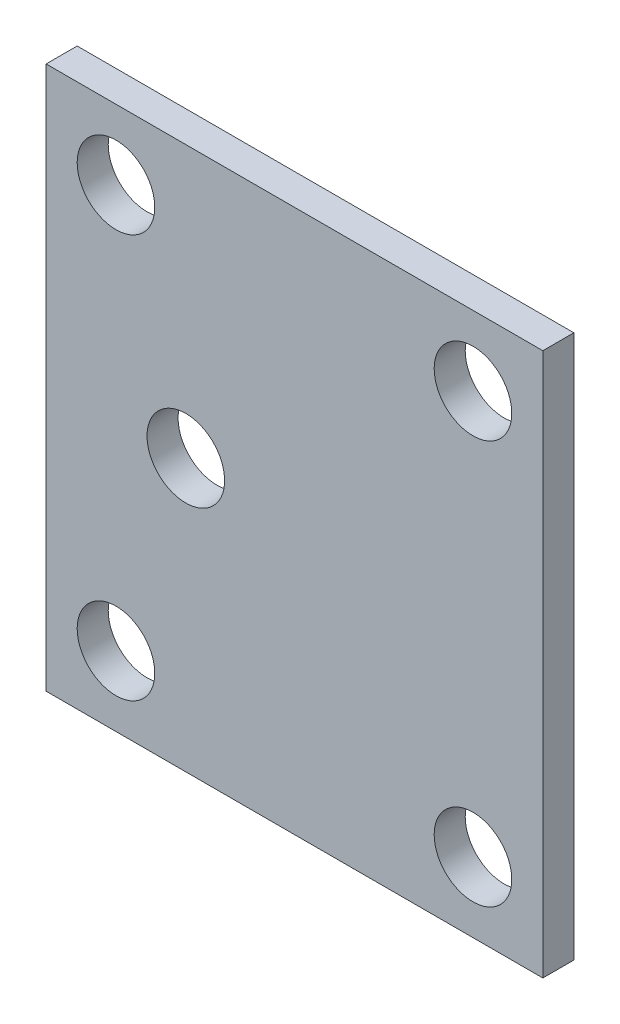
ISO-10303-21;
HEADER;
FILE_DESCRIPTION(('STEP AP214'),'2;1');
FILE_NAME('part.step','',(''),(''),'','','');
FILE_SCHEMA(('AUTOMOTIVE_DESIGN { 1 0 10303 214 1 1 1 1 }'));
ENDSEC;
DATA;
#1=APPLICATION_CONTEXT('core data for automotive mechanical design processes');
#2=APPLICATION_PROTOCOL_DEFINITION('international standard','automotive_design',2000,#1);
#3=PRODUCT_CONTEXT('',#1,'mechanical');
#4=PRODUCT('Part','Part','',(#3));
#5=PRODUCT_RELATED_PRODUCT_CATEGORY('part','',(#4));
#6=PRODUCT_DEFINITION_FORMATION('','',#4);
#7=PRODUCT_DEFINITION_CONTEXT('part definition',#1,'design');
#8=PRODUCT_DEFINITION('design','',#6,#7);
#9=PRODUCT_DEFINITION_SHAPE('','',#8);
#10=(LENGTH_UNIT() NAMED_UNIT(*) SI_UNIT(.MILLI.,.METRE.));
#11=(NAMED_UNIT(*) PLANE_ANGLE_UNIT() SI_UNIT($,.RADIAN.));
#12=(NAMED_UNIT(*) SI_UNIT($,.STERADIAN.) SOLID_ANGLE_UNIT());
#13=UNCERTAINTY_MEASURE_WITH_UNIT(LENGTH_MEASURE(1.E-05),#10,'distance_accuracy_value','');
#14=(GEOMETRIC_REPRESENTATION_CONTEXT(3) GLOBAL_UNCERTAINTY_ASSIGNED_CONTEXT((#13)) GLOBAL_UNIT_ASSIGNED_CONTEXT((#10,
#11,#12)) REPRESENTATION_CONTEXT('',''));
#15=CARTESIAN_POINT('',(0.,0.,0.));
#16=DIRECTION('',(0.,0.,1.));
#17=DIRECTION('',(1.,0.,0.));
#18=AXIS2_PLACEMENT_3D('',#15,#16,#17);
#19=CARTESIAN_POINT('',(0.,0.,2.));
#20=DIRECTION('',(0.,0.,1.));
#21=DIRECTION('',(1.,0.,0.));
#22=AXIS2_PLACEMENT_3D('',#19,#20,#21);
#23=PLANE('',#22);
#24=CARTESIAN_POINT('',(-5.33,-5.24999999999999,2.));
#25=DIRECTION('',(0.,0.,-1.));
#26=DIRECTION('',(-1.,0.,0.));
#27=AXIS2_PLACEMENT_3D('',#24,#25,#26);
#28=CIRCLE('',#27,2.5);
#29=CARTESIAN_POINT('',(-7.82999999999999,-5.24999999999999,2.));
#30=VERTEX_POINT('',#29);
#31=EDGE_CURVE('E146',#30,#30,#28,.T.);
#32=ORIENTED_EDGE('',*,*,#31,.T.);
#33=EDGE_LOOP('',(#32));
#34=FACE_BOUND('',#33,.T.);
#35=DIRECTION('',(0.,-1.,0.));
#36=VECTOR('',#35,1.);
#37=CARTESIAN_POINT('',(-14.33,12.25,2.));
#38=LINE('',#37,#36);
#39=CARTESIAN_POINT('',(-14.33,12.25,2.));
#40=VERTEX_POINT('',#39);
#41=CARTESIAN_POINT('',(-14.33,-22.75,2.));
#42=VERTEX_POINT('',#41);
#43=EDGE_CURVE('E97',#40,#42,#38,.T.);
#44=ORIENTED_EDGE('',*,*,#43,.T.);
#45=DIRECTION('',(1.,0.,0.));
#46=VECTOR('',#45,1.);
#47=CARTESIAN_POINT('',(-14.33,-22.75,2.));
#48=LINE('',#47,#46);
#49=CARTESIAN_POINT('',(17.67,-22.75,2.));
#50=VERTEX_POINT('',#49);
#51=EDGE_CURVE('E92',#42,#50,#48,.T.);
#52=ORIENTED_EDGE('',*,*,#51,.T.);
#53=DIRECTION('',(0.,1.,0.));
#54=VECTOR('',#53,1.);
#55=CARTESIAN_POINT('',(17.67,12.25,2.));
#56=LINE('',#55,#54);
#57=CARTESIAN_POINT('',(17.67,12.25,2.));
#58=VERTEX_POINT('',#57);
#59=EDGE_CURVE('E95',#50,#58,#56,.T.);
#60=ORIENTED_EDGE('',*,*,#59,.T.);
#61=DIRECTION('',(-1.,0.,0.));
#62=VECTOR('',#61,1.);
#63=CARTESIAN_POINT('',(-14.33,12.25,2.));
#64=LINE('',#63,#62);
#65=EDGE_CURVE('E62',#58,#40,#64,.T.);
#66=ORIENTED_EDGE('',*,*,#65,.T.);
#67=EDGE_LOOP('',(#44,#52,#60,#66));
#68=FACE_BOUND('',#67,.T.);
#69=CARTESIAN_POINT('',(-9.83,7.75,2.));
#70=DIRECTION('',(0.,0.,-1.));
#71=DIRECTION('',(-1.,0.,0.));
#72=AXIS2_PLACEMENT_3D('',#69,#70,#71);
#73=CIRCLE('',#72,2.5);
#74=CARTESIAN_POINT('',(-12.33,7.75,2.));
#75=VERTEX_POINT('',#74);
#76=EDGE_CURVE('E112',#75,#75,#73,.T.);
#77=ORIENTED_EDGE('',*,*,#76,.T.);
#78=EDGE_LOOP('',(#77));
#79=FACE_BOUND('',#78,.T.);
#80=CARTESIAN_POINT('',(13.17,7.75,2.));
#81=DIRECTION('',(0.,0.,-1.));
#82=DIRECTION('',(-1.,0.,0.));
#83=AXIS2_PLACEMENT_3D('',#80,#81,#82);
#84=CIRCLE('',#83,2.5);
#85=CARTESIAN_POINT('',(10.67,7.75,2.));
#86=VERTEX_POINT('',#85);
#87=EDGE_CURVE('E128',#86,#86,#84,.T.);
#88=ORIENTED_EDGE('',*,*,#87,.T.);
#89=EDGE_LOOP('',(#88));
#90=FACE_BOUND('',#89,.T.);
#91=CARTESIAN_POINT('',(13.17,-18.25,2.));
#92=DIRECTION('',(0.,0.,-1.));
#93=DIRECTION('',(-1.,0.,0.));
#94=AXIS2_PLACEMENT_3D('',#91,#92,#93);
#95=CIRCLE('',#94,2.5);
#96=CARTESIAN_POINT('',(10.67,-18.25,2.));
#97=VERTEX_POINT('',#96);
#98=EDGE_CURVE('E134',#97,#97,#95,.T.);
#99=ORIENTED_EDGE('',*,*,#98,.T.);
#100=EDGE_LOOP('',(#99));
#101=FACE_BOUND('',#100,.T.);
#102=CARTESIAN_POINT('',(-9.82999999999999,-18.25,2.));
#103=DIRECTION('',(0.,0.,-1.));
#104=DIRECTION('',(-1.,0.,0.));
#105=AXIS2_PLACEMENT_3D('',#102,#103,#104);
#106=CIRCLE('',#105,2.5);
#107=CARTESIAN_POINT('',(-12.33,-18.25,2.));
#108=VERTEX_POINT('',#107);
#109=EDGE_CURVE('E140',#108,#108,#106,.T.);
#110=ORIENTED_EDGE('',*,*,#109,.T.);
#111=EDGE_LOOP('',(#110));
#112=FACE_BOUND('',#111,.T.);
#113=ADVANCED_FACE('F45',(#34,#68,#79,#90,#101,#112),#23,.T.);
#114=CARTESIAN_POINT('',(-14.33,12.25,2.));
#115=DIRECTION('',(1.,0.,0.));
#116=DIRECTION('',(0.,1.,0.));
#117=AXIS2_PLACEMENT_3D('',#114,#115,#116);
#118=PLANE('',#117);
#119=DIRECTION('',(0.,-1.,0.));
#120=VECTOR('',#119,1.);
#121=CARTESIAN_POINT('',(-14.33,12.25,0.));
#122=LINE('',#121,#120);
#123=CARTESIAN_POINT('',(-14.33,12.25,0.));
#124=VERTEX_POINT('',#123);
#125=CARTESIAN_POINT('',(-14.33,-22.75,0.));
#126=VERTEX_POINT('',#125);
#127=EDGE_CURVE('E109',#124,#126,#122,.T.);
#128=ORIENTED_EDGE('',*,*,#127,.T.);
#129=DIRECTION('',(0.,0.,-1.));
#130=VECTOR('',#129,1.);
#131=CARTESIAN_POINT('',(-14.33,-22.75,2.));
#132=LINE('',#131,#130);
#133=EDGE_CURVE('E11',#42,#126,#132,.T.);
#134=ORIENTED_EDGE('',*,*,#133,.F.);
#135=ORIENTED_EDGE('',*,*,#43,.F.);
#136=DIRECTION('',(0.,0.,-1.));
#137=VECTOR('',#136,1.);
#138=CARTESIAN_POINT('',(-14.33,12.25,2.));
#139=LINE('',#138,#137);
#140=EDGE_CURVE('E105',#40,#124,#139,.T.);
#141=ORIENTED_EDGE('',*,*,#140,.T.);
#142=EDGE_LOOP('',(#128,#134,#135,#141));
#143=FACE_BOUND('',#142,.T.);
#144=ADVANCED_FACE('F47',(#143),#118,.F.);
#145=CARTESIAN_POINT('',(-14.33,-22.75,2.));
#146=DIRECTION('',(0.,1.,0.));
#147=DIRECTION('',(0.,0.,1.));
#148=AXIS2_PLACEMENT_3D('',#145,#146,#147);
#149=PLANE('',#148);
#150=DIRECTION('',(1.,0.,0.));
#151=VECTOR('',#150,1.);
#152=CARTESIAN_POINT('',(-14.33,-22.75,0.));
#153=LINE('',#152,#151);
#154=CARTESIAN_POINT('',(17.67,-22.75,0.));
#155=VERTEX_POINT('',#154);
#156=EDGE_CURVE('E101',#126,#155,#153,.T.);
#157=ORIENTED_EDGE('',*,*,#156,.T.);
#158=DIRECTION('',(0.,0.,-1.));
#159=VECTOR('',#158,1.);
#160=CARTESIAN_POINT('',(17.67,-22.75,2.));
#161=LINE('',#160,#159);
#162=EDGE_CURVE('E54',#50,#155,#161,.T.);
#163=ORIENTED_EDGE('',*,*,#162,.F.);
#164=ORIENTED_EDGE('',*,*,#51,.F.);
#165=ORIENTED_EDGE('',*,*,#133,.T.);
#166=EDGE_LOOP('',(#157,#163,#164,#165));
#167=FACE_BOUND('',#166,.T.);
#168=ADVANCED_FACE('F100',(#167),#149,.F.);
#169=CARTESIAN_POINT('',(17.67,12.25,2.));
#170=DIRECTION('',(-1.,0.,0.));
#171=DIRECTION('',(0.,0.,1.));
#172=AXIS2_PLACEMENT_3D('',#169,#170,#171);
#173=PLANE('',#172);
#174=DIRECTION('',(0.,1.,0.));
#175=VECTOR('',#174,1.);
#176=CARTESIAN_POINT('',(17.67,12.25,0.));
#177=LINE('',#176,#175);
#178=CARTESIAN_POINT('',(17.67,12.25,0.));
#179=VERTEX_POINT('',#178);
#180=EDGE_CURVE('E79',#155,#179,#177,.T.);
#181=ORIENTED_EDGE('',*,*,#180,.T.);
#182=DIRECTION('',(0.,0.,-1.));
#183=VECTOR('',#182,1.);
#184=CARTESIAN_POINT('',(17.67,12.25,2.));
#185=LINE('',#184,#183);
#186=EDGE_CURVE('E102',#58,#179,#185,.T.);
#187=ORIENTED_EDGE('',*,*,#186,.F.);
#188=ORIENTED_EDGE('',*,*,#59,.F.);
#189=ORIENTED_EDGE('',*,*,#162,.T.);
#190=EDGE_LOOP('',(#181,#187,#188,#189));
#191=FACE_BOUND('',#190,.T.);
#192=ADVANCED_FACE('F103',(#191),#173,.F.);
#193=CARTESIAN_POINT('',(-14.33,12.25,2.));
#194=DIRECTION('',(0.,-1.,0.));
#195=DIRECTION('',(0.,0.,-1.));
#196=AXIS2_PLACEMENT_3D('',#193,#194,#195);
#197=PLANE('',#196);
#198=DIRECTION('',(-1.,0.,0.));
#199=VECTOR('',#198,1.);
#200=CARTESIAN_POINT('',(-14.33,12.25,0.));
#201=LINE('',#200,#199);
#202=EDGE_CURVE('E85',#179,#124,#201,.T.);
#203=ORIENTED_EDGE('',*,*,#202,.T.);
#204=ORIENTED_EDGE('',*,*,#140,.F.);
#205=ORIENTED_EDGE('',*,*,#65,.F.);
#206=ORIENTED_EDGE('',*,*,#186,.T.);
#207=EDGE_LOOP('',(#203,#204,#205,#206));
#208=FACE_BOUND('',#207,.T.);
#209=ADVANCED_FACE('F117',(#208),#197,.F.);
#210=CARTESIAN_POINT('',(0.,0.,0.));
#211=DIRECTION('',(0.,0.,1.));
#212=DIRECTION('',(1.,0.,0.));
#213=AXIS2_PLACEMENT_3D('',#210,#211,#212);
#214=PLANE('',#213);
#215=CARTESIAN_POINT('',(-5.33,-5.24999999999999,0.));
#216=DIRECTION('',(0.,0.,-1.));
#217=DIRECTION('',(-1.,0.,0.));
#218=AXIS2_PLACEMENT_3D('',#215,#216,#217);
#219=CIRCLE('',#218,2.49999999999999);
#220=CARTESIAN_POINT('',(-7.82999999999998,-5.24999999999999,0.));
#221=VERTEX_POINT('',#220);
#222=EDGE_CURVE('E149',#221,#221,#219,.T.);
#223=ORIENTED_EDGE('',*,*,#222,.F.);
#224=EDGE_LOOP('',(#223));
#225=FACE_BOUND('',#224,.T.);
#226=CARTESIAN_POINT('',(-9.82999999999999,-18.25,0.));
#227=DIRECTION('',(0.,0.,-1.));
#228=DIRECTION('',(-1.,0.,0.));
#229=AXIS2_PLACEMENT_3D('',#226,#227,#228);
#230=CIRCLE('',#229,2.49999999999999);
#231=CARTESIAN_POINT('',(-12.33,-18.25,0.));
#232=VERTEX_POINT('',#231);
#233=EDGE_CURVE('E143',#232,#232,#230,.T.);
#234=ORIENTED_EDGE('',*,*,#233,.F.);
#235=EDGE_LOOP('',(#234));
#236=FACE_BOUND('',#235,.T.);
#237=CARTESIAN_POINT('',(13.17,-18.25,0.));
#238=DIRECTION('',(0.,0.,-1.));
#239=DIRECTION('',(-1.,0.,0.));
#240=AXIS2_PLACEMENT_3D('',#237,#238,#239);
#241=CIRCLE('',#240,2.49999999999999);
#242=CARTESIAN_POINT('',(10.67,-18.25,0.));
#243=VERTEX_POINT('',#242);
#244=EDGE_CURVE('E137',#243,#243,#241,.T.);
#245=ORIENTED_EDGE('',*,*,#244,.F.);
#246=EDGE_LOOP('',(#245));
#247=FACE_BOUND('',#246,.T.);
#248=CARTESIAN_POINT('',(13.17,7.75,0.));
#249=DIRECTION('',(0.,0.,-1.));
#250=DIRECTION('',(-1.,0.,0.));
#251=AXIS2_PLACEMENT_3D('',#248,#249,#250);
#252=CIRCLE('',#251,2.49999999999999);
#253=CARTESIAN_POINT('',(10.67,7.75,0.));
#254=VERTEX_POINT('',#253);
#255=EDGE_CURVE('E131',#254,#254,#252,.T.);
#256=ORIENTED_EDGE('',*,*,#255,.F.);
#257=EDGE_LOOP('',(#256));
#258=FACE_BOUND('',#257,.T.);
#259=CARTESIAN_POINT('',(-9.83,7.75,0.));
#260=DIRECTION('',(0.,0.,-1.));
#261=DIRECTION('',(-1.,0.,0.));
#262=AXIS2_PLACEMENT_3D('',#259,#260,#261);
#263=CIRCLE('',#262,2.49999999999999);
#264=CARTESIAN_POINT('',(-12.33,7.75,0.));
#265=VERTEX_POINT('',#264);
#266=EDGE_CURVE('E125',#265,#265,#263,.T.);
#267=ORIENTED_EDGE('',*,*,#266,.F.);
#268=EDGE_LOOP('',(#267));
#269=FACE_BOUND('',#268,.T.);
#270=ORIENTED_EDGE('',*,*,#127,.F.);
#271=ORIENTED_EDGE('',*,*,#202,.F.);
#272=ORIENTED_EDGE('',*,*,#180,.F.);
#273=ORIENTED_EDGE('',*,*,#156,.F.);
#274=EDGE_LOOP('',(#270,#271,#272,#273));
#275=FACE_BOUND('',#274,.T.);
#276=ADVANCED_FACE('F120',(#225,#236,#247,#258,#269,#275),#214,.F.);
#277=CARTESIAN_POINT('',(-9.83,7.75,0.));
#278=DIRECTION('',(0.,0.,-1.));
#279=DIRECTION('',(-1.,0.,0.));
#280=AXIS2_PLACEMENT_3D('',#277,#278,#279);
#281=CYLINDRICAL_SURFACE('',#280,2.49999999999999);
#282=ORIENTED_EDGE('',*,*,#76,.F.);
#283=EDGE_LOOP('',(#282));
#284=FACE_BOUND('',#283,.T.);
#285=ORIENTED_EDGE('',*,*,#266,.T.);
#286=EDGE_LOOP('',(#285));
#287=FACE_BOUND('',#286,.T.);
#288=ADVANCED_FACE('F157',(#284,#287),#281,.F.);
#289=CARTESIAN_POINT('',(13.17,7.75,0.));
#290=DIRECTION('',(0.,0.,-1.));
#291=DIRECTION('',(-1.,0.,0.));
#292=AXIS2_PLACEMENT_3D('',#289,#290,#291);
#293=CYLINDRICAL_SURFACE('',#292,2.49999999999999);
#294=ORIENTED_EDGE('',*,*,#87,.F.);
#295=EDGE_LOOP('',(#294));
#296=FACE_BOUND('',#295,.T.);
#297=ORIENTED_EDGE('',*,*,#255,.T.);
#298=EDGE_LOOP('',(#297));
#299=FACE_BOUND('',#298,.T.);
#300=ADVANCED_FACE('F168',(#296,#299),#293,.F.);
#301=CARTESIAN_POINT('',(13.17,-18.25,0.));
#302=DIRECTION('',(0.,0.,-1.));
#303=DIRECTION('',(-1.,0.,0.));
#304=AXIS2_PLACEMENT_3D('',#301,#302,#303);
#305=CYLINDRICAL_SURFACE('',#304,2.49999999999999);
#306=ORIENTED_EDGE('',*,*,#98,.F.);
#307=EDGE_LOOP('',(#306));
#308=FACE_BOUND('',#307,.T.);
#309=ORIENTED_EDGE('',*,*,#244,.T.);
#310=EDGE_LOOP('',(#309));
#311=FACE_BOUND('',#310,.T.);
#312=ADVANCED_FACE('F175',(#308,#311),#305,.F.);
#313=CARTESIAN_POINT('',(-9.82999999999999,-18.25,0.));
#314=DIRECTION('',(0.,0.,-1.));
#315=DIRECTION('',(-1.,0.,0.));
#316=AXIS2_PLACEMENT_3D('',#313,#314,#315);
#317=CYLINDRICAL_SURFACE('',#316,2.49999999999999);
#318=ORIENTED_EDGE('',*,*,#109,.F.);
#319=EDGE_LOOP('',(#318));
#320=FACE_BOUND('',#319,.T.);
#321=ORIENTED_EDGE('',*,*,#233,.T.);
#322=EDGE_LOOP('',(#321));
#323=FACE_BOUND('',#322,.T.);
#324=ADVANCED_FACE('F220',(#320,#323),#317,.F.);
#325=CARTESIAN_POINT('',(-5.33,-5.24999999999999,0.));
#326=DIRECTION('',(0.,0.,-1.));
#327=DIRECTION('',(-1.,0.,0.));
#328=AXIS2_PLACEMENT_3D('',#325,#326,#327);
#329=CYLINDRICAL_SURFACE('',#328,2.49999999999999);
#330=ORIENTED_EDGE('',*,*,#31,.F.);
#331=EDGE_LOOP('',(#330));
#332=FACE_BOUND('',#331,.T.);
#333=ORIENTED_EDGE('',*,*,#222,.T.);
#334=EDGE_LOOP('',(#333));
#335=FACE_BOUND('',#334,.T.);
#336=ADVANCED_FACE('F153',(#332,#335),#329,.F.);
#337=CLOSED_SHELL('',(#113,#144,#168,#192,#209,#276,#288,#300,#312,#324,#336));
#338=MANIFOLD_SOLID_BREP('B2',#337);
#339=ADVANCED_BREP_SHAPE_REPRESENTATION('',(#18,#338),#14);
#340=SHAPE_DEFINITION_REPRESENTATION(#9,#339);
ENDSEC;
END-ISO-10303-21;
